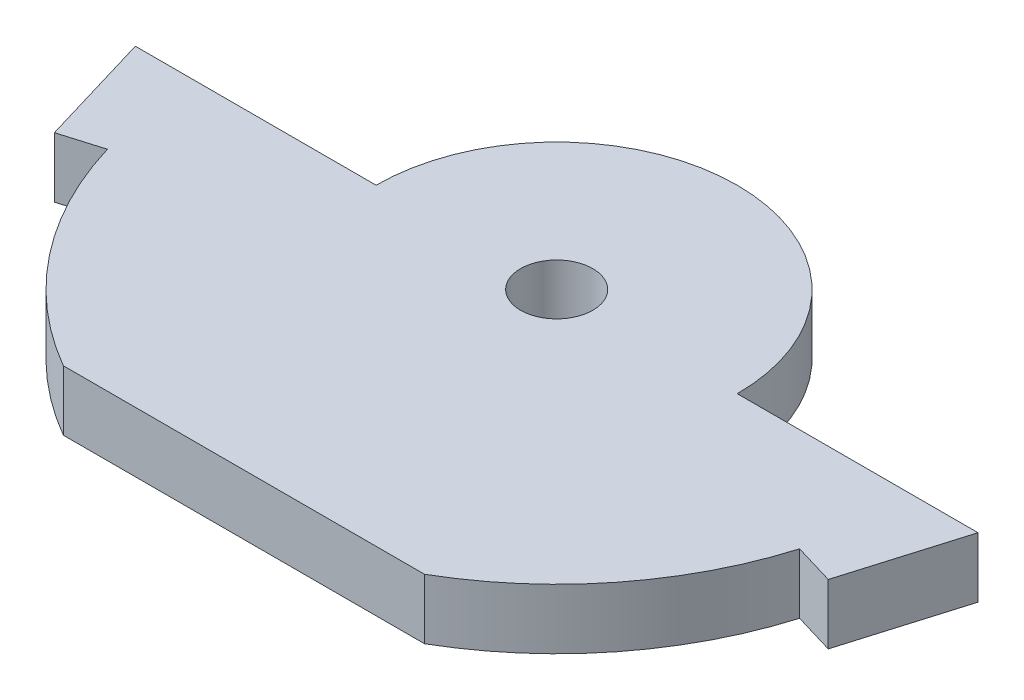
ISO-10303-21;
HEADER;
FILE_DESCRIPTION(('STEP AP214'),'2;1');
FILE_NAME('part.step','',(''),(''),'','','');
FILE_SCHEMA(('AUTOMOTIVE_DESIGN { 1 0 10303 214 1 1 1 1 }'));
ENDSEC;
DATA;
#1=APPLICATION_CONTEXT('core data for automotive mechanical design processes');
#2=APPLICATION_PROTOCOL_DEFINITION('international standard','automotive_design',2000,#1);
#3=PRODUCT_CONTEXT('',#1,'mechanical');
#4=PRODUCT('Part','Part','',(#3));
#5=PRODUCT_RELATED_PRODUCT_CATEGORY('part','',(#4));
#6=PRODUCT_DEFINITION_FORMATION('','',#4);
#7=PRODUCT_DEFINITION_CONTEXT('part definition',#1,'design');
#8=PRODUCT_DEFINITION('design','',#6,#7);
#9=PRODUCT_DEFINITION_SHAPE('','',#8);
#10=(LENGTH_UNIT() NAMED_UNIT(*) SI_UNIT(.MILLI.,.METRE.));
#11=(NAMED_UNIT(*) PLANE_ANGLE_UNIT() SI_UNIT($,.RADIAN.));
#12=(NAMED_UNIT(*) SI_UNIT($,.STERADIAN.) SOLID_ANGLE_UNIT());
#13=UNCERTAINTY_MEASURE_WITH_UNIT(LENGTH_MEASURE(1.E-05),#10,'distance_accuracy_value','');
#14=(GEOMETRIC_REPRESENTATION_CONTEXT(3) GLOBAL_UNCERTAINTY_ASSIGNED_CONTEXT((#13)) GLOBAL_UNIT_ASSIGNED_CONTEXT((#10,
#11,#12)) REPRESENTATION_CONTEXT('',''));
#15=CARTESIAN_POINT('',(0.,0.,0.));
#16=DIRECTION('',(0.,0.,1.));
#17=DIRECTION('',(1.,0.,0.));
#18=AXIS2_PLACEMENT_3D('',#15,#16,#17);
#19=CARTESIAN_POINT('',(0.,5.,25.9807621135332));
#20=DIRECTION('',(0.,0.,-1.));
#21=DIRECTION('',(-1.,0.,0.));
#22=AXIS2_PLACEMENT_3D('',#19,#20,#21);
#23=PLANE('',#22);
#24=DIRECTION('',(1.,0.,0.));
#25=VECTOR('',#24,1.);
#26=CARTESIAN_POINT('',(0.,0.,25.9807621135332));
#27=LINE('',#26,#25);
#28=CARTESIAN_POINT('',(-15.,0.,25.9807621135332));
#29=VERTEX_POINT('',#28);
#30=CARTESIAN_POINT('',(15.,0.,25.9807621135332));
#31=VERTEX_POINT('',#30);
#32=EDGE_CURVE('E149',#29,#31,#27,.T.);
#33=ORIENTED_EDGE('',*,*,#32,.T.);
#34=DIRECTION('',(0.,-1.,0.));
#35=VECTOR('',#34,1.);
#36=CARTESIAN_POINT('',(15.,5.,25.9807621135332));
#37=LINE('',#36,#35);
#38=CARTESIAN_POINT('',(15.,5.,25.9807621135332));
#39=VERTEX_POINT('',#38);
#40=EDGE_CURVE('E11',#39,#31,#37,.T.);
#41=ORIENTED_EDGE('',*,*,#40,.F.);
#42=DIRECTION('',(1.,0.,0.));
#43=VECTOR('',#42,1.);
#44=CARTESIAN_POINT('',(0.,5.,25.9807621135332));
#45=LINE('',#44,#43);
#46=CARTESIAN_POINT('',(-15.,5.,25.9807621135332));
#47=VERTEX_POINT('',#46);
#48=EDGE_CURVE('E204',#47,#39,#45,.T.);
#49=ORIENTED_EDGE('',*,*,#48,.F.);
#50=DIRECTION('',(0.,-1.,0.));
#51=VECTOR('',#50,1.);
#52=CARTESIAN_POINT('',(-15.,5.,25.9807621135332));
#53=LINE('',#52,#51);
#54=EDGE_CURVE('E142',#47,#29,#53,.T.);
#55=ORIENTED_EDGE('',*,*,#54,.T.);
#56=EDGE_LOOP('',(#33,#41,#49,#55));
#57=FACE_BOUND('',#56,.T.);
#58=ADVANCED_FACE('F36',(#57),#23,.F.);
#59=CARTESIAN_POINT('',(0.,5.,0.));
#60=DIRECTION('',(0.,-1.,0.));
#61=DIRECTION('',(0.,0.,-1.));
#62=AXIS2_PLACEMENT_3D('',#59,#60,#61);
#63=CYLINDRICAL_SURFACE('',#62,30.);
#64=CARTESIAN_POINT('',(0.,0.,0.));
#65=DIRECTION('',(0.,1.,0.));
#66=DIRECTION('',(0.,0.,1.));
#67=AXIS2_PLACEMENT_3D('',#64,#65,#66);
#68=CIRCLE('',#67,30.);
#69=CARTESIAN_POINT('',(28.7494454249973,0.,8.57142857142861));
#70=VERTEX_POINT('',#69);
#71=EDGE_CURVE('E152',#31,#70,#68,.T.);
#72=ORIENTED_EDGE('',*,*,#71,.T.);
#73=DIRECTION('',(0.,-1.,0.));
#74=VECTOR('',#73,1.);
#75=CARTESIAN_POINT('',(28.7494454249973,5.,8.57142857142861));
#76=LINE('',#75,#74);
#77=CARTESIAN_POINT('',(28.7494454249973,5.,8.57142857142861));
#78=VERTEX_POINT('',#77);
#79=EDGE_CURVE('E45',#78,#70,#76,.T.);
#80=ORIENTED_EDGE('',*,*,#79,.F.);
#81=CARTESIAN_POINT('',(0.,5.,0.));
#82=DIRECTION('',(0.,1.,0.));
#83=DIRECTION('',(0.,0.,1.));
#84=AXIS2_PLACEMENT_3D('',#81,#82,#83);
#85=CIRCLE('',#84,30.);
#86=EDGE_CURVE('E102',#39,#78,#85,.T.);
#87=ORIENTED_EDGE('',*,*,#86,.F.);
#88=ORIENTED_EDGE('',*,*,#40,.T.);
#89=EDGE_LOOP('',(#72,#80,#87,#88));
#90=FACE_BOUND('',#89,.T.);
#91=ADVANCED_FACE('F187',(#90),#63,.T.);
#92=CARTESIAN_POINT('',(-1.15483019972166E-13,5.,3.87341824357109E-13));
#93=DIRECTION('',(-0.285714285714274,0.,0.958314847499913));
#94=DIRECTION('',(0.958314847499913,0.,0.285714285714274));
#95=AXIS2_PLACEMENT_3D('',#92,#93,#94);
#96=PLANE('',#95);
#97=DIRECTION('',(-0.958314847499913,0.,-0.285714285714274));
#98=VECTOR('',#97,1.);
#99=CARTESIAN_POINT('',(-1.15483019972166E-13,0.,3.87341824357109E-13));
#100=LINE('',#99,#98);
#101=CARTESIAN_POINT('',(32.1428571428571,0.,9.58314847499909));
#102=VERTEX_POINT('',#101);
#103=EDGE_CURVE('E155',#102,#70,#100,.T.);
#104=ORIENTED_EDGE('',*,*,#103,.F.);
#105=DIRECTION('',(0.,-1.,0.));
#106=VECTOR('',#105,1.);
#107=CARTESIAN_POINT('',(32.1428571428571,5.,9.58314847499909));
#108=LINE('',#107,#106);
#109=CARTESIAN_POINT('',(32.1428571428571,5.,9.58314847499909));
#110=VERTEX_POINT('',#109);
#111=EDGE_CURVE('E180',#110,#102,#108,.T.);
#112=ORIENTED_EDGE('',*,*,#111,.F.);
#113=DIRECTION('',(-0.958314847499913,0.,-0.285714285714274));
#114=VECTOR('',#113,1.);
#115=CARTESIAN_POINT('',(-1.15483019972166E-13,5.,3.87341824357109E-13));
#116=LINE('',#115,#114);
#117=EDGE_CURVE('E186',#110,#78,#116,.T.);
#118=ORIENTED_EDGE('',*,*,#117,.T.);
#119=ORIENTED_EDGE('',*,*,#79,.T.);
#120=EDGE_LOOP('',(#104,#112,#118,#119));
#121=FACE_BOUND('',#120,.T.);
#122=ADVANCED_FACE('F184',(#121),#96,.T.);
#123=CARTESIAN_POINT('',(32.1428571428571,5.,9.5831484749991));
#124=DIRECTION('',(0.95831484749991,0.,0.285714285714286));
#125=DIRECTION('',(0.285714285714286,0.,-0.95831484749991));
#126=AXIS2_PLACEMENT_3D('',#123,#124,#125);
#127=PLANE('',#126);
#128=DIRECTION('',(-0.285714285714286,0.,0.95831484749991));
#129=VECTOR('',#128,1.);
#130=CARTESIAN_POINT('',(32.1428571428571,0.,9.5831484749991));
#131=LINE('',#130,#129);
#132=CARTESIAN_POINT('',(35.,0.,0.));
#133=VERTEX_POINT('',#132);
#134=EDGE_CURVE('E158',#133,#102,#131,.T.);
#135=ORIENTED_EDGE('',*,*,#134,.F.);
#136=DIRECTION('',(0.,-1.,0.));
#137=VECTOR('',#136,1.);
#138=CARTESIAN_POINT('',(35.,5.,0.));
#139=LINE('',#138,#137);
#140=CARTESIAN_POINT('',(35.,5.,0.));
#141=VERTEX_POINT('',#140);
#142=EDGE_CURVE('E178',#141,#133,#139,.T.);
#143=ORIENTED_EDGE('',*,*,#142,.F.);
#144=DIRECTION('',(-0.285714285714286,0.,0.95831484749991));
#145=VECTOR('',#144,1.);
#146=CARTESIAN_POINT('',(32.1428571428571,5.,9.5831484749991));
#147=LINE('',#146,#145);
#148=EDGE_CURVE('E198',#141,#110,#147,.T.);
#149=ORIENTED_EDGE('',*,*,#148,.T.);
#150=ORIENTED_EDGE('',*,*,#111,.T.);
#151=EDGE_LOOP('',(#135,#143,#149,#150));
#152=FACE_BOUND('',#151,.T.);
#153=ADVANCED_FACE('F195',(#152),#127,.T.);
#154=CARTESIAN_POINT('',(0.,5.,0.));
#155=DIRECTION('',(0.,0.,-1.));
#156=DIRECTION('',(-1.,0.,0.));
#157=AXIS2_PLACEMENT_3D('',#154,#155,#156);
#158=PLANE('',#157);
#159=DIRECTION('',(1.,0.,0.));
#160=VECTOR('',#159,1.);
#161=CARTESIAN_POINT('',(0.,0.,0.));
#162=LINE('',#161,#160);
#163=CARTESIAN_POINT('',(15.,0.,0.));
#164=VERTEX_POINT('',#163);
#165=EDGE_CURVE('E161',#164,#133,#162,.T.);
#166=ORIENTED_EDGE('',*,*,#165,.F.);
#167=DIRECTION('',(0.,-1.,0.));
#168=VECTOR('',#167,1.);
#169=CARTESIAN_POINT('',(15.,5.,0.));
#170=LINE('',#169,#168);
#171=CARTESIAN_POINT('',(15.,5.,0.));
#172=VERTEX_POINT('',#171);
#173=EDGE_CURVE('E176',#172,#164,#170,.T.);
#174=ORIENTED_EDGE('',*,*,#173,.F.);
#175=DIRECTION('',(1.,0.,0.));
#176=VECTOR('',#175,1.);
#177=CARTESIAN_POINT('',(0.,5.,0.));
#178=LINE('',#177,#176);
#179=EDGE_CURVE('E202',#172,#141,#178,.T.);
#180=ORIENTED_EDGE('',*,*,#179,.T.);
#181=ORIENTED_EDGE('',*,*,#142,.T.);
#182=EDGE_LOOP('',(#166,#174,#180,#181));
#183=FACE_BOUND('',#182,.T.);
#184=ADVANCED_FACE('F214',(#183),#158,.T.);
#185=CARTESIAN_POINT('',(0.,5.,0.));
#186=DIRECTION('',(0.,-1.,0.));
#187=DIRECTION('',(0.,0.,-1.));
#188=AXIS2_PLACEMENT_3D('',#185,#186,#187);
#189=CYLINDRICAL_SURFACE('',#188,15.);
#190=CARTESIAN_POINT('',(0.,0.,0.));
#191=DIRECTION('',(0.,1.,0.));
#192=DIRECTION('',(0.,0.,1.));
#193=AXIS2_PLACEMENT_3D('',#190,#191,#192);
#194=CIRCLE('',#193,15.);
#195=CARTESIAN_POINT('',(-15.,0.,0.));
#196=VERTEX_POINT('',#195);
#197=EDGE_CURVE('E164',#196,#164,#194,.F.);
#198=ORIENTED_EDGE('',*,*,#197,.F.);
#199=DIRECTION('',(0.,-1.,0.));
#200=VECTOR('',#199,1.);
#201=CARTESIAN_POINT('',(-15.,5.,0.));
#202=LINE('',#201,#200);
#203=CARTESIAN_POINT('',(-15.,5.,0.));
#204=VERTEX_POINT('',#203);
#205=EDGE_CURVE('E174',#204,#196,#202,.T.);
#206=ORIENTED_EDGE('',*,*,#205,.F.);
#207=CARTESIAN_POINT('',(0.,5.,0.));
#208=DIRECTION('',(0.,1.,0.));
#209=DIRECTION('',(0.,0.,1.));
#210=AXIS2_PLACEMENT_3D('',#207,#208,#209);
#211=CIRCLE('',#210,15.);
#212=EDGE_CURVE('E208',#204,#172,#211,.F.);
#213=ORIENTED_EDGE('',*,*,#212,.T.);
#214=ORIENTED_EDGE('',*,*,#173,.T.);
#215=EDGE_LOOP('',(#198,#206,#213,#214));
#216=FACE_BOUND('',#215,.T.);
#217=ADVANCED_FACE('F212',(#216),#189,.T.);
#218=CARTESIAN_POINT('',(0.,5.,0.));
#219=DIRECTION('',(0.,0.,1.));
#220=DIRECTION('',(1.,0.,0.));
#221=AXIS2_PLACEMENT_3D('',#218,#219,#220);
#222=PLANE('',#221);
#223=DIRECTION('',(-1.,0.,0.));
#224=VECTOR('',#223,1.);
#225=CARTESIAN_POINT('',(0.,0.,0.));
#226=LINE('',#225,#224);
#227=CARTESIAN_POINT('',(-35.,0.,0.));
#228=VERTEX_POINT('',#227);
#229=EDGE_CURVE('E167',#196,#228,#226,.T.);
#230=ORIENTED_EDGE('',*,*,#229,.T.);
#231=DIRECTION('',(0.,-1.,0.));
#232=VECTOR('',#231,1.);
#233=CARTESIAN_POINT('',(-35.,5.,0.));
#234=LINE('',#233,#232);
#235=CARTESIAN_POINT('',(-35.,5.,0.));
#236=VERTEX_POINT('',#235);
#237=EDGE_CURVE('E137',#236,#228,#234,.T.);
#238=ORIENTED_EDGE('',*,*,#237,.F.);
#239=DIRECTION('',(-1.,0.,0.));
#240=VECTOR('',#239,1.);
#241=CARTESIAN_POINT('',(0.,5.,0.));
#242=LINE('',#241,#240);
#243=EDGE_CURVE('E128',#204,#236,#242,.T.);
#244=ORIENTED_EDGE('',*,*,#243,.F.);
#245=ORIENTED_EDGE('',*,*,#205,.T.);
#246=EDGE_LOOP('',(#230,#238,#244,#245));
#247=FACE_BOUND('',#246,.T.);
#248=ADVANCED_FACE('F217',(#247),#222,.F.);
#249=CARTESIAN_POINT('',(-32.1428571428571,5.,9.5831484749991));
#250=DIRECTION('',(0.95831484749991,0.,-0.285714285714286));
#251=DIRECTION('',(-0.285714285714286,0.,-0.95831484749991));
#252=AXIS2_PLACEMENT_3D('',#249,#250,#251);
#253=PLANE('',#252);
#254=DIRECTION('',(0.285714285714286,0.,0.95831484749991));
#255=VECTOR('',#254,1.);
#256=CARTESIAN_POINT('',(-32.1428571428571,0.,9.5831484749991));
#257=LINE('',#256,#255);
#258=CARTESIAN_POINT('',(-32.1428571428571,0.,9.5831484749991));
#259=VERTEX_POINT('',#258);
#260=EDGE_CURVE('E136',#228,#259,#257,.T.);
#261=ORIENTED_EDGE('',*,*,#260,.T.);
#262=DIRECTION('',(0.,-1.,0.));
#263=VECTOR('',#262,1.);
#264=CARTESIAN_POINT('',(-32.1428571428571,5.,9.5831484749991));
#265=LINE('',#264,#263);
#266=CARTESIAN_POINT('',(-32.1428571428571,5.,9.5831484749991));
#267=VERTEX_POINT('',#266);
#268=EDGE_CURVE('E133',#267,#259,#265,.T.);
#269=ORIENTED_EDGE('',*,*,#268,.F.);
#270=DIRECTION('',(0.285714285714286,0.,0.95831484749991));
#271=VECTOR('',#270,1.);
#272=CARTESIAN_POINT('',(-32.1428571428571,5.,9.5831484749991));
#273=LINE('',#272,#271);
#274=EDGE_CURVE('E121',#236,#267,#273,.T.);
#275=ORIENTED_EDGE('',*,*,#274,.F.);
#276=ORIENTED_EDGE('',*,*,#237,.T.);
#277=EDGE_LOOP('',(#261,#269,#275,#276));
#278=FACE_BOUND('',#277,.T.);
#279=ADVANCED_FACE('F134',(#278),#253,.F.);
#280=CARTESIAN_POINT('',(1.17465561087568E-13,5.,3.9399146941045E-13));
#281=DIRECTION('',(-0.285714285714274,0.,-0.958314847499913));
#282=DIRECTION('',(-0.958314847499913,0.,0.285714285714274));
#283=AXIS2_PLACEMENT_3D('',#280,#281,#282);
#284=PLANE('',#283);
#285=DIRECTION('',(0.958314847499913,0.,-0.285714285714274));
#286=VECTOR('',#285,1.);
#287=CARTESIAN_POINT('',(1.17465561087568E-13,0.,3.9399146941045E-13));
#288=LINE('',#287,#286);
#289=CARTESIAN_POINT('',(-28.7494454249973,0.,8.57142857142861));
#290=VERTEX_POINT('',#289);
#291=EDGE_CURVE('E88',#259,#290,#288,.T.);
#292=ORIENTED_EDGE('',*,*,#291,.T.);
#293=DIRECTION('',(0.,-1.,0.));
#294=VECTOR('',#293,1.);
#295=CARTESIAN_POINT('',(-28.7494454249973,5.,8.57142857142861));
#296=LINE('',#295,#294);
#297=CARTESIAN_POINT('',(-28.7494454249973,5.,8.57142857142861));
#298=VERTEX_POINT('',#297);
#299=EDGE_CURVE('E138',#298,#290,#296,.T.);
#300=ORIENTED_EDGE('',*,*,#299,.F.);
#301=DIRECTION('',(0.958314847499913,0.,-0.285714285714274));
#302=VECTOR('',#301,1.);
#303=CARTESIAN_POINT('',(1.17465561087568E-13,5.,3.9399146941045E-13));
#304=LINE('',#303,#302);
#305=EDGE_CURVE('E125',#267,#298,#304,.T.);
#306=ORIENTED_EDGE('',*,*,#305,.F.);
#307=ORIENTED_EDGE('',*,*,#268,.T.);
#308=EDGE_LOOP('',(#292,#300,#306,#307));
#309=FACE_BOUND('',#308,.T.);
#310=ADVANCED_FACE('F140',(#309),#284,.F.);
#311=CARTESIAN_POINT('',(0.,5.,0.));
#312=DIRECTION('',(0.,-1.,0.));
#313=DIRECTION('',(0.,0.,-1.));
#314=AXIS2_PLACEMENT_3D('',#311,#312,#313);
#315=CYLINDRICAL_SURFACE('',#314,3.);
#316=CARTESIAN_POINT('',(0.,5.,0.));
#317=DIRECTION('',(0.,1.,0.));
#318=DIRECTION('',(0.,0.,1.));
#319=AXIS2_PLACEMENT_3D('',#316,#317,#318);
#320=CIRCLE('',#319,3.);
#321=CARTESIAN_POINT('',(0.,5.,3.));
#322=VERTEX_POINT('',#321);
#323=EDGE_CURVE('E307',#322,#322,#320,.T.);
#324=ORIENTED_EDGE('',*,*,#323,.T.);
#325=EDGE_LOOP('',(#324));
#326=FACE_BOUND('',#325,.T.);
#327=CARTESIAN_POINT('',(0.,0.,0.));
#328=DIRECTION('',(0.,1.,0.));
#329=DIRECTION('',(0.,0.,1.));
#330=AXIS2_PLACEMENT_3D('',#327,#328,#329);
#331=CIRCLE('',#330,3.);
#332=CARTESIAN_POINT('',(0.,0.,3.));
#333=VERTEX_POINT('',#332);
#334=EDGE_CURVE('E146',#333,#333,#331,.T.);
#335=ORIENTED_EDGE('',*,*,#334,.F.);
#336=EDGE_LOOP('',(#335));
#337=FACE_BOUND('',#336,.T.);
#338=ADVANCED_FACE('F38',(#326,#337),#315,.F.);
#339=EDGE_CURVE('E94',#290,#29,#68,.T.);
#340=ORIENTED_EDGE('',*,*,#339,.T.);
#341=ORIENTED_EDGE('',*,*,#54,.F.);
#342=EDGE_CURVE('E53',#298,#47,#85,.T.);
#343=ORIENTED_EDGE('',*,*,#342,.F.);
#344=ORIENTED_EDGE('',*,*,#299,.T.);
#345=EDGE_LOOP('',(#340,#341,#343,#344));
#346=FACE_BOUND('',#345,.T.);
#347=ADVANCED_FACE('F232',(#346),#63,.T.);
#348=CARTESIAN_POINT('',(0.,5.,0.));
#349=DIRECTION('',(0.,1.,0.));
#350=DIRECTION('',(0.,0.,1.));
#351=AXIS2_PLACEMENT_3D('',#348,#349,#350);
#352=PLANE('',#351);
#353=ORIENTED_EDGE('',*,*,#323,.F.);
#354=EDGE_LOOP('',(#353));
#355=FACE_BOUND('',#354,.T.);
#356=ORIENTED_EDGE('',*,*,#48,.T.);
#357=ORIENTED_EDGE('',*,*,#86,.T.);
#358=ORIENTED_EDGE('',*,*,#117,.F.);
#359=ORIENTED_EDGE('',*,*,#148,.F.);
#360=ORIENTED_EDGE('',*,*,#179,.F.);
#361=ORIENTED_EDGE('',*,*,#212,.F.);
#362=ORIENTED_EDGE('',*,*,#243,.T.);
#363=ORIENTED_EDGE('',*,*,#274,.T.);
#364=ORIENTED_EDGE('',*,*,#305,.T.);
#365=ORIENTED_EDGE('',*,*,#342,.T.);
#366=EDGE_LOOP('',(#356,#357,#358,#359,#360,#361,#362,#363,#364,#365));
#367=FACE_BOUND('',#366,.T.);
#368=ADVANCED_FACE('F123',(#355,#367),#352,.T.);
#369=CARTESIAN_POINT('',(0.,0.,0.));
#370=DIRECTION('',(0.,1.,0.));
#371=DIRECTION('',(0.,0.,1.));
#372=AXIS2_PLACEMENT_3D('',#369,#370,#371);
#373=PLANE('',#372);
#374=ORIENTED_EDGE('',*,*,#334,.T.);
#375=EDGE_LOOP('',(#374));
#376=FACE_BOUND('',#375,.T.);
#377=ORIENTED_EDGE('',*,*,#32,.F.);
#378=ORIENTED_EDGE('',*,*,#339,.F.);
#379=ORIENTED_EDGE('',*,*,#291,.F.);
#380=ORIENTED_EDGE('',*,*,#260,.F.);
#381=ORIENTED_EDGE('',*,*,#229,.F.);
#382=ORIENTED_EDGE('',*,*,#197,.T.);
#383=ORIENTED_EDGE('',*,*,#165,.T.);
#384=ORIENTED_EDGE('',*,*,#134,.T.);
#385=ORIENTED_EDGE('',*,*,#103,.T.);
#386=ORIENTED_EDGE('',*,*,#71,.F.);
#387=EDGE_LOOP('',(#377,#378,#379,#380,#381,#382,#383,#384,#385,#386));
#388=FACE_BOUND('',#387,.T.);
#389=ADVANCED_FACE('F191',(#376,#388),#373,.F.);
#390=CLOSED_SHELL('',(#58,#91,#122,#153,#184,#217,#248,#279,#310,#338,#347,#368,#389));
#391=MANIFOLD_SOLID_BREP('B2',#390);
#392=ADVANCED_BREP_SHAPE_REPRESENTATION('',(#18,#391),#14);
#393=SHAPE_DEFINITION_REPRESENTATION(#9,#392);
ENDSEC;
END-ISO-10303-21;
